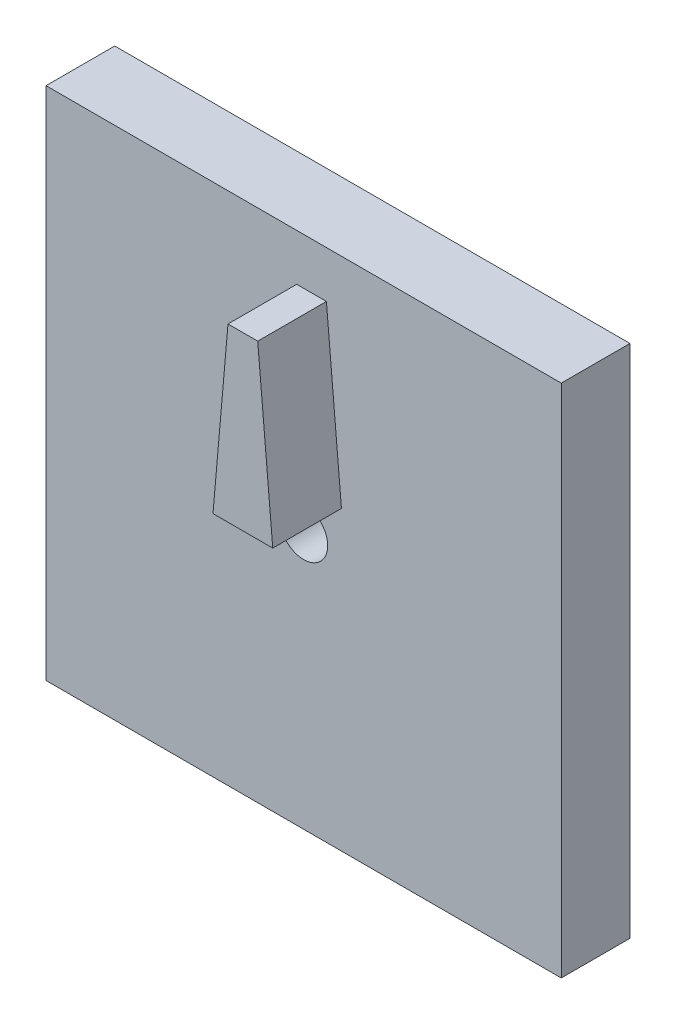
ISO-10303-21;
HEADER;
FILE_DESCRIPTION(('STEP AP214'),'2;1');
FILE_NAME('part.step','',(''),(''),'','','');
FILE_SCHEMA(('AUTOMOTIVE_DESIGN { 1 0 10303 214 1 1 1 1 }'));
ENDSEC;
DATA;
#1=APPLICATION_CONTEXT('core data for automotive mechanical design processes');
#2=APPLICATION_PROTOCOL_DEFINITION('international standard','automotive_design',2000,#1);
#3=PRODUCT_CONTEXT('',#1,'mechanical');
#4=PRODUCT('Part','Part','',(#3));
#5=PRODUCT_RELATED_PRODUCT_CATEGORY('part','',(#4));
#6=PRODUCT_DEFINITION_FORMATION('','',#4);
#7=PRODUCT_DEFINITION_CONTEXT('part definition',#1,'design');
#8=PRODUCT_DEFINITION('design','',#6,#7);
#9=PRODUCT_DEFINITION_SHAPE('','',#8);
#10=(LENGTH_UNIT() NAMED_UNIT(*) SI_UNIT(.MILLI.,.METRE.));
#11=(NAMED_UNIT(*) PLANE_ANGLE_UNIT() SI_UNIT($,.RADIAN.));
#12=(NAMED_UNIT(*) SI_UNIT($,.STERADIAN.) SOLID_ANGLE_UNIT());
#13=UNCERTAINTY_MEASURE_WITH_UNIT(LENGTH_MEASURE(1.E-05),#10,'distance_accuracy_value','');
#14=(GEOMETRIC_REPRESENTATION_CONTEXT(3) GLOBAL_UNCERTAINTY_ASSIGNED_CONTEXT((#13)) GLOBAL_UNIT_ASSIGNED_CONTEXT((#10,
#11,#12)) REPRESENTATION_CONTEXT('',''));
#15=CARTESIAN_POINT('',(0.,0.,0.));
#16=DIRECTION('',(0.,0.,1.));
#17=DIRECTION('',(1.,0.,0.));
#18=AXIS2_PLACEMENT_3D('',#15,#16,#17);
#19=CARTESIAN_POINT('',(-9.525,-9.525,0.));
#20=DIRECTION('',(0.,0.,1.));
#21=DIRECTION('',(1.,0.,0.));
#22=AXIS2_PLACEMENT_3D('',#19,#20,#21);
#23=PLANE('',#22);
#24=DIRECTION('',(0.,-1.,0.));
#25=VECTOR('',#24,1.);
#26=CARTESIAN_POINT('',(-9.525,9.525,0.));
#27=LINE('',#26,#25);
#28=CARTESIAN_POINT('',(-9.525,9.525,0.));
#29=VERTEX_POINT('',#28);
#30=CARTESIAN_POINT('',(-9.525,-9.525,0.));
#31=VERTEX_POINT('',#30);
#32=EDGE_CURVE('E483',#29,#31,#27,.T.);
#33=ORIENTED_EDGE('',*,*,#32,.T.);
#34=DIRECTION('',(1.,0.,0.));
#35=VECTOR('',#34,1.);
#36=CARTESIAN_POINT('',(-9.525,-9.525,0.));
#37=LINE('',#36,#35);
#38=CARTESIAN_POINT('',(9.525,-9.525,0.));
#39=VERTEX_POINT('',#38);
#40=EDGE_CURVE('E486',#31,#39,#37,.T.);
#41=ORIENTED_EDGE('',*,*,#40,.T.);
#42=DIRECTION('',(0.,1.,0.));
#43=VECTOR('',#42,1.);
#44=CARTESIAN_POINT('',(9.525,9.525,0.));
#45=LINE('',#44,#43);
#46=CARTESIAN_POINT('',(9.525,9.525,0.));
#47=VERTEX_POINT('',#46);
#48=EDGE_CURVE('E489',#39,#47,#45,.T.);
#49=ORIENTED_EDGE('',*,*,#48,.T.);
#50=DIRECTION('',(-1.,0.,0.));
#51=VECTOR('',#50,1.);
#52=CARTESIAN_POINT('',(-9.525,9.525,0.));
#53=LINE('',#52,#51);
#54=EDGE_CURVE('E492',#47,#29,#53,.T.);
#55=ORIENTED_EDGE('',*,*,#54,.T.);
#56=EDGE_LOOP('',(#33,#41,#49,#55));
#57=FACE_BOUND('',#56,.T.);
#58=CARTESIAN_POINT('',(0.,0.,0.));
#59=DIRECTION('',(0.,0.,1.));
#60=DIRECTION('',(1.,0.,0.));
#61=AXIS2_PLACEMENT_3D('',#58,#59,#60);
#62=CIRCLE('',#61,0.889);
#63=CARTESIAN_POINT('',(0.889,0.,0.));
#64=VERTEX_POINT('',#63);
#65=EDGE_CURVE('E449',#64,#64,#62,.T.);
#66=ORIENTED_EDGE('',*,*,#65,.F.);
#67=EDGE_LOOP('',(#66));
#68=FACE_BOUND('',#67,.T.);
#69=DIRECTION('',(1.,0.,0.));
#70=VECTOR('',#69,1.);
#71=CARTESIAN_POINT('',(-0.8128,1.4478,0.));
#72=LINE('',#71,#70);
#73=CARTESIAN_POINT('',(-0.8128,1.4478,0.));
#74=VERTEX_POINT('',#73);
#75=CARTESIAN_POINT('',(1.397,1.4478,0.));
#76=VERTEX_POINT('',#75);
#77=EDGE_CURVE('E443',#74,#76,#72,.T.);
#78=ORIENTED_EDGE('',*,*,#77,.F.);
#79=DIRECTION('',(-0.0871557427476598,-0.996194698091746,0.));
#80=VECTOR('',#79,1.);
#81=CARTESIAN_POINT('',(-0.257246986610373,7.7978,0.));
#82=LINE('',#81,#80);
#83=CARTESIAN_POINT('',(-0.257246986610373,7.7978,0.));
#84=VERTEX_POINT('',#83);
#85=EDGE_CURVE('E454',#84,#74,#82,.T.);
#86=ORIENTED_EDGE('',*,*,#85,.F.);
#87=DIRECTION('',(-1.,0.,0.));
#88=VECTOR('',#87,1.);
#89=CARTESIAN_POINT('',(-0.257246986610373,7.7978,0.));
#90=LINE('',#89,#88);
#91=CARTESIAN_POINT('',(0.841446986610392,7.7978,0.));
#92=VERTEX_POINT('',#91);
#93=EDGE_CURVE('E464',#92,#84,#90,.T.);
#94=ORIENTED_EDGE('',*,*,#93,.F.);
#95=DIRECTION('',(-0.0871557427476568,0.996194698091746,0.));
#96=VECTOR('',#95,1.);
#97=CARTESIAN_POINT('',(0.841446986610391,7.7978,0.));
#98=LINE('',#97,#96);
#99=EDGE_CURVE('E462',#76,#92,#98,.T.);
#100=ORIENTED_EDGE('',*,*,#99,.F.);
#101=EDGE_LOOP('',(#78,#86,#94,#100));
#102=FACE_BOUND('',#101,.T.);
#103=ADVANCED_FACE('F372',(#57,#68,#102),#23,.T.);
#104=CARTESIAN_POINT('',(-9.525,9.525,-2.54));
#105=DIRECTION('',(-1.,0.,0.));
#106=DIRECTION('',(0.,-1.,0.));
#107=AXIS2_PLACEMENT_3D('',#104,#105,#106);
#108=PLANE('',#107);
#109=ORIENTED_EDGE('',*,*,#32,.F.);
#110=DIRECTION('',(0.,0.,1.));
#111=VECTOR('',#110,1.);
#112=CARTESIAN_POINT('',(-9.525,9.525,-2.54));
#113=LINE('',#112,#111);
#114=CARTESIAN_POINT('',(-9.525,9.525,-2.54));
#115=VERTEX_POINT('',#114);
#116=EDGE_CURVE('E11',#115,#29,#113,.T.);
#117=ORIENTED_EDGE('',*,*,#116,.F.);
#118=DIRECTION('',(0.,-1.,0.));
#119=VECTOR('',#118,1.);
#120=CARTESIAN_POINT('',(-9.525,9.525,-2.54));
#121=LINE('',#120,#119);
#122=CARTESIAN_POINT('',(-9.525,-9.525,-2.54));
#123=VERTEX_POINT('',#122);
#124=EDGE_CURVE('E495',#115,#123,#121,.T.);
#125=ORIENTED_EDGE('',*,*,#124,.T.);
#126=DIRECTION('',(0.,0.,1.));
#127=VECTOR('',#126,1.);
#128=CARTESIAN_POINT('',(-9.525,-9.525,-2.54));
#129=LINE('',#128,#127);
#130=EDGE_CURVE('E376',#123,#31,#129,.T.);
#131=ORIENTED_EDGE('',*,*,#130,.T.);
#132=EDGE_LOOP('',(#109,#117,#125,#131));
#133=FACE_BOUND('',#132,.T.);
#134=ADVANCED_FACE('F374',(#133),#108,.T.);
#135=CARTESIAN_POINT('',(-9.525,9.525,-2.54));
#136=DIRECTION('',(0.,1.,0.));
#137=DIRECTION('',(0.,0.,1.));
#138=AXIS2_PLACEMENT_3D('',#135,#136,#137);
#139=PLANE('',#138);
#140=ORIENTED_EDGE('',*,*,#54,.F.);
#141=DIRECTION('',(0.,0.,1.));
#142=VECTOR('',#141,1.);
#143=CARTESIAN_POINT('',(9.525,9.525,-2.54));
#144=LINE('',#143,#142);
#145=CARTESIAN_POINT('',(9.525,9.525,-2.54));
#146=VERTEX_POINT('',#145);
#147=EDGE_CURVE('E381',#146,#47,#144,.T.);
#148=ORIENTED_EDGE('',*,*,#147,.F.);
#149=DIRECTION('',(-1.,0.,0.));
#150=VECTOR('',#149,1.);
#151=CARTESIAN_POINT('',(-9.525,9.525,-2.54));
#152=LINE('',#151,#150);
#153=EDGE_CURVE('E503',#146,#115,#152,.T.);
#154=ORIENTED_EDGE('',*,*,#153,.T.);
#155=ORIENTED_EDGE('',*,*,#116,.T.);
#156=EDGE_LOOP('',(#140,#148,#154,#155));
#157=FACE_BOUND('',#156,.T.);
#158=ADVANCED_FACE('F516',(#157),#139,.T.);
#159=CARTESIAN_POINT('',(9.525,9.525,-2.54));
#160=DIRECTION('',(1.,0.,0.));
#161=DIRECTION('',(0.,1.,0.));
#162=AXIS2_PLACEMENT_3D('',#159,#160,#161);
#163=PLANE('',#162);
#164=ORIENTED_EDGE('',*,*,#48,.F.);
#165=DIRECTION('',(0.,0.,1.));
#166=VECTOR('',#165,1.);
#167=CARTESIAN_POINT('',(9.525,-9.525,-2.54));
#168=LINE('',#167,#166);
#169=CARTESIAN_POINT('',(9.525,-9.525,-2.54));
#170=VERTEX_POINT('',#169);
#171=EDGE_CURVE('E506',#170,#39,#168,.T.);
#172=ORIENTED_EDGE('',*,*,#171,.F.);
#173=DIRECTION('',(0.,1.,0.));
#174=VECTOR('',#173,1.);
#175=CARTESIAN_POINT('',(9.525,9.525,-2.54));
#176=LINE('',#175,#174);
#177=EDGE_CURVE('E500',#170,#146,#176,.T.);
#178=ORIENTED_EDGE('',*,*,#177,.T.);
#179=ORIENTED_EDGE('',*,*,#147,.T.);
#180=EDGE_LOOP('',(#164,#172,#178,#179));
#181=FACE_BOUND('',#180,.T.);
#182=ADVANCED_FACE('F522',(#181),#163,.T.);
#183=CARTESIAN_POINT('',(-9.525,-9.525,-2.54));
#184=DIRECTION('',(0.,-1.,0.));
#185=DIRECTION('',(0.,0.,-1.));
#186=AXIS2_PLACEMENT_3D('',#183,#184,#185);
#187=PLANE('',#186);
#188=ORIENTED_EDGE('',*,*,#40,.F.);
#189=ORIENTED_EDGE('',*,*,#130,.F.);
#190=DIRECTION('',(1.,0.,0.));
#191=VECTOR('',#190,1.);
#192=CARTESIAN_POINT('',(-9.525,-9.525,-2.54));
#193=LINE('',#192,#191);
#194=EDGE_CURVE('E497',#123,#170,#193,.T.);
#195=ORIENTED_EDGE('',*,*,#194,.T.);
#196=ORIENTED_EDGE('',*,*,#171,.T.);
#197=EDGE_LOOP('',(#188,#189,#195,#196));
#198=FACE_BOUND('',#197,.T.);
#199=ADVANCED_FACE('F511',(#198),#187,.T.);
#200=CARTESIAN_POINT('',(-9.525,-9.525,-2.54));
#201=DIRECTION('',(0.,0.,1.));
#202=DIRECTION('',(1.,0.,0.));
#203=AXIS2_PLACEMENT_3D('',#200,#201,#202);
#204=PLANE('',#203);
#205=CARTESIAN_POINT('',(0.,0.,-2.54));
#206=DIRECTION('',(0.,0.,1.));
#207=DIRECTION('',(1.,0.,0.));
#208=AXIS2_PLACEMENT_3D('',#205,#206,#207);
#209=CIRCLE('',#208,0.889);
#210=CARTESIAN_POINT('',(0.889,0.,-2.54));
#211=VERTEX_POINT('',#210);
#212=EDGE_CURVE('E480',#211,#211,#209,.T.);
#213=ORIENTED_EDGE('',*,*,#212,.T.);
#214=EDGE_LOOP('',(#213));
#215=FACE_BOUND('',#214,.T.);
#216=ORIENTED_EDGE('',*,*,#124,.F.);
#217=ORIENTED_EDGE('',*,*,#153,.F.);
#218=ORIENTED_EDGE('',*,*,#177,.F.);
#219=ORIENTED_EDGE('',*,*,#194,.F.);
#220=EDGE_LOOP('',(#216,#217,#218,#219));
#221=FACE_BOUND('',#220,.T.);
#222=ADVANCED_FACE('F520',(#215,#221),#204,.F.);
#223=CARTESIAN_POINT('',(0.,0.,-2.54));
#224=DIRECTION('',(0.,0.,1.));
#225=DIRECTION('',(1.,0.,0.));
#226=AXIS2_PLACEMENT_3D('',#223,#224,#225);
#227=CYLINDRICAL_SURFACE('',#226,0.889);
#228=ORIENTED_EDGE('',*,*,#212,.F.);
#229=EDGE_LOOP('',(#228));
#230=FACE_BOUND('',#229,.T.);
#231=ORIENTED_EDGE('',*,*,#65,.T.);
#232=EDGE_LOOP('',(#231));
#233=FACE_BOUND('',#232,.T.);
#234=ADVANCED_FACE('F539',(#230,#233),#227,.F.);
#235=CARTESIAN_POINT('',(-0.257246986610373,7.7978,2.54));
#236=DIRECTION('',(0.996194698091745,-0.0871557427476598,0.));
#237=DIRECTION('',(0.0871557427476598,0.996194698091746,0.));
#238=AXIS2_PLACEMENT_3D('',#235,#236,#237);
#239=PLANE('',#238);
#240=ORIENTED_EDGE('',*,*,#85,.T.);
#241=DIRECTION('',(0.,0.,-1.));
#242=VECTOR('',#241,1.);
#243=CARTESIAN_POINT('',(-0.8128,1.4478,2.54));
#244=LINE('',#243,#242);
#245=CARTESIAN_POINT('',(-0.8128,1.4478,2.54));
#246=VERTEX_POINT('',#245);
#247=EDGE_CURVE('E438',#246,#74,#244,.T.);
#248=ORIENTED_EDGE('',*,*,#247,.F.);
#249=DIRECTION('',(-0.0871557427476598,-0.996194698091746,0.));
#250=VECTOR('',#249,1.);
#251=CARTESIAN_POINT('',(-0.257246986610373,7.7978,2.54));
#252=LINE('',#251,#250);
#253=CARTESIAN_POINT('',(-0.257246986610373,7.7978,2.54));
#254=VERTEX_POINT('',#253);
#255=EDGE_CURVE('E468',#254,#246,#252,.T.);
#256=ORIENTED_EDGE('',*,*,#255,.F.);
#257=DIRECTION('',(0.,0.,-1.));
#258=VECTOR('',#257,1.);
#259=CARTESIAN_POINT('',(-0.257246986610373,7.7978,2.54));
#260=LINE('',#259,#258);
#261=EDGE_CURVE('E457',#254,#84,#260,.T.);
#262=ORIENTED_EDGE('',*,*,#261,.T.);
#263=EDGE_LOOP('',(#240,#248,#256,#262));
#264=FACE_BOUND('',#263,.T.);
#265=ADVANCED_FACE('F455',(#264),#239,.F.);
#266=CARTESIAN_POINT('',(-0.8128,1.4478,2.54));
#267=DIRECTION('',(0.,1.,0.));
#268=DIRECTION('',(0.,0.,1.));
#269=AXIS2_PLACEMENT_3D('',#266,#267,#268);
#270=PLANE('',#269);
#271=ORIENTED_EDGE('',*,*,#77,.T.);
#272=DIRECTION('',(0.,0.,-1.));
#273=VECTOR('',#272,1.);
#274=CARTESIAN_POINT('',(1.397,1.4478,2.54));
#275=LINE('',#274,#273);
#276=CARTESIAN_POINT('',(1.397,1.4478,2.54));
#277=VERTEX_POINT('',#276);
#278=EDGE_CURVE('E450',#277,#76,#275,.T.);
#279=ORIENTED_EDGE('',*,*,#278,.F.);
#280=DIRECTION('',(1.,0.,0.));
#281=VECTOR('',#280,1.);
#282=CARTESIAN_POINT('',(-0.8128,1.4478,2.54));
#283=LINE('',#282,#281);
#284=EDGE_CURVE('E445',#246,#277,#283,.T.);
#285=ORIENTED_EDGE('',*,*,#284,.F.);
#286=ORIENTED_EDGE('',*,*,#247,.T.);
#287=EDGE_LOOP('',(#271,#279,#285,#286));
#288=FACE_BOUND('',#287,.T.);
#289=ADVANCED_FACE('F440',(#288),#270,.F.);
#290=CARTESIAN_POINT('',(0.841446986610391,7.7978,2.54));
#291=DIRECTION('',(-0.996194698091746,-0.0871557427476568,0.));
#292=DIRECTION('',(0.0871557427476568,-0.996194698091746,0.));
#293=AXIS2_PLACEMENT_3D('',#290,#291,#292);
#294=PLANE('',#293);
#295=ORIENTED_EDGE('',*,*,#99,.T.);
#296=DIRECTION('',(0.,0.,-1.));
#297=VECTOR('',#296,1.);
#298=CARTESIAN_POINT('',(0.841446986610391,7.7978,2.54));
#299=LINE('',#298,#297);
#300=CARTESIAN_POINT('',(0.841446986610391,7.7978,2.54));
#301=VERTEX_POINT('',#300);
#302=EDGE_CURVE('E389',#301,#92,#299,.T.);
#303=ORIENTED_EDGE('',*,*,#302,.F.);
#304=DIRECTION('',(-0.0871557427476568,0.996194698091746,0.));
#305=VECTOR('',#304,1.);
#306=CARTESIAN_POINT('',(0.841446986610391,7.7978,2.54));
#307=LINE('',#306,#305);
#308=EDGE_CURVE('E471',#277,#301,#307,.T.);
#309=ORIENTED_EDGE('',*,*,#308,.F.);
#310=ORIENTED_EDGE('',*,*,#278,.T.);
#311=EDGE_LOOP('',(#295,#303,#309,#310));
#312=FACE_BOUND('',#311,.T.);
#313=ADVANCED_FACE('F554',(#312),#294,.F.);
#314=CARTESIAN_POINT('',(-0.257246986610373,7.7978,2.54));
#315=DIRECTION('',(0.,-1.,0.));
#316=DIRECTION('',(0.,0.,-1.));
#317=AXIS2_PLACEMENT_3D('',#314,#315,#316);
#318=PLANE('',#317);
#319=ORIENTED_EDGE('',*,*,#93,.T.);
#320=ORIENTED_EDGE('',*,*,#261,.F.);
#321=DIRECTION('',(-1.,0.,0.));
#322=VECTOR('',#321,1.);
#323=CARTESIAN_POINT('',(-0.257246986610373,7.7978,2.54));
#324=LINE('',#323,#322);
#325=EDGE_CURVE('E473',#301,#254,#324,.T.);
#326=ORIENTED_EDGE('',*,*,#325,.F.);
#327=ORIENTED_EDGE('',*,*,#302,.T.);
#328=EDGE_LOOP('',(#319,#320,#326,#327));
#329=FACE_BOUND('',#328,.T.);
#330=ADVANCED_FACE('F559',(#329),#318,.F.);
#331=CARTESIAN_POINT('',(-0.8128,1.4478,2.54));
#332=DIRECTION('',(0.,0.,1.));
#333=DIRECTION('',(1.,0.,0.));
#334=AXIS2_PLACEMENT_3D('',#331,#332,#333);
#335=PLANE('',#334);
#336=ORIENTED_EDGE('',*,*,#255,.T.);
#337=ORIENTED_EDGE('',*,*,#284,.T.);
#338=ORIENTED_EDGE('',*,*,#308,.T.);
#339=ORIENTED_EDGE('',*,*,#325,.T.);
#340=EDGE_LOOP('',(#336,#337,#338,#339));
#341=FACE_BOUND('',#340,.T.);
#342=ADVANCED_FACE('F563',(#341),#335,.T.);
#343=CLOSED_SHELL('',(#103,#134,#158,#182,#199,#222,#234,#265,#289,#313,#330,#342));
#344=MANIFOLD_SOLID_BREP('B2',#343);
#345=ADVANCED_BREP_SHAPE_REPRESENTATION('',(#18,#344),#14);
#346=SHAPE_DEFINITION_REPRESENTATION(#9,#345);
ENDSEC;
END-ISO-10303-21;
